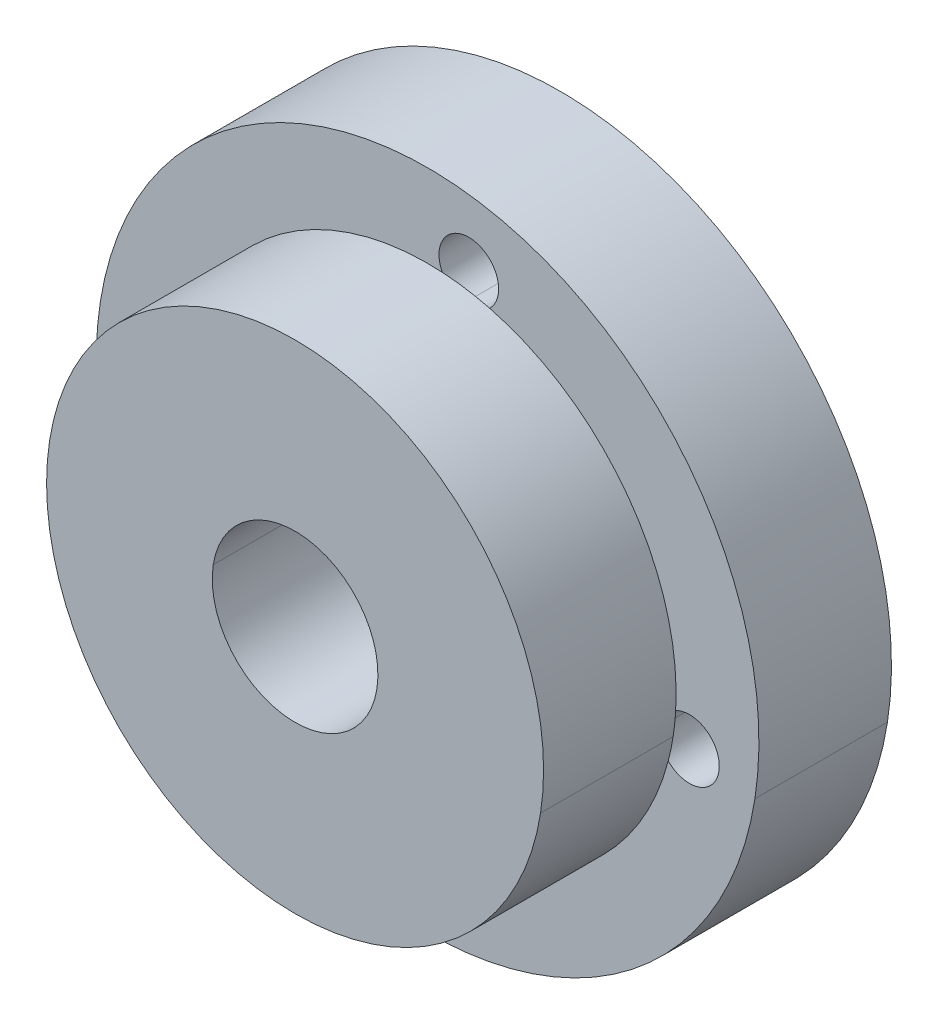
ISO-10303-21;
HEADER;
FILE_DESCRIPTION(('STEP AP214'),'2;1');
FILE_NAME('part.step','',(''),(''),'','','');
FILE_SCHEMA(('AUTOMOTIVE_DESIGN { 1 0 10303 214 1 1 1 1 }'));
ENDSEC;
DATA;
#1=APPLICATION_CONTEXT('core data for automotive mechanical design processes');
#2=APPLICATION_PROTOCOL_DEFINITION('international standard','automotive_design',2000,#1);
#3=PRODUCT_CONTEXT('',#1,'mechanical');
#4=PRODUCT('Part','Part','',(#3));
#5=PRODUCT_RELATED_PRODUCT_CATEGORY('part','',(#4));
#6=PRODUCT_DEFINITION_FORMATION('','',#4);
#7=PRODUCT_DEFINITION_CONTEXT('part definition',#1,'design');
#8=PRODUCT_DEFINITION('design','',#6,#7);
#9=PRODUCT_DEFINITION_SHAPE('','',#8);
#10=(LENGTH_UNIT() NAMED_UNIT(*) SI_UNIT(.MILLI.,.METRE.));
#11=(NAMED_UNIT(*) PLANE_ANGLE_UNIT() SI_UNIT($,.RADIAN.));
#12=(NAMED_UNIT(*) SI_UNIT($,.STERADIAN.) SOLID_ANGLE_UNIT());
#13=UNCERTAINTY_MEASURE_WITH_UNIT(LENGTH_MEASURE(1.E-05),#10,'distance_accuracy_value','');
#14=(GEOMETRIC_REPRESENTATION_CONTEXT(3) GLOBAL_UNCERTAINTY_ASSIGNED_CONTEXT((#13)) GLOBAL_UNIT_ASSIGNED_CONTEXT((#10,
#11,#12)) REPRESENTATION_CONTEXT('',''));
#15=CARTESIAN_POINT('',(0.,0.,0.));
#16=DIRECTION('',(0.,0.,1.));
#17=DIRECTION('',(1.,0.,0.));
#18=AXIS2_PLACEMENT_3D('',#15,#16,#17);
#19=CARTESIAN_POINT('',(172.540515397,-49.500004703,198.848278345));
#20=DIRECTION('',(0.,0.,1.));
#21=DIRECTION('',(1.,0.,0.));
#22=AXIS2_PLACEMENT_3D('',#19,#20,#21);
#23=PLANE('',#22);
#24=CARTESIAN_POINT('',(164.637737646,-48.256580477,198.848278346));
#25=DIRECTION('',(0.,0.,-1.));
#26=DIRECTION('',(0.98784721901284,-0.155428028002022,0.));
#27=AXIS2_PLACEMENT_3D('',#24,#25,#26);
#28=CIRCLE('',#27,0.900000000000014);
#29=CARTESIAN_POINT('',(165.278722749,-47.624806706,198.848278346));
#30=VERTEX_POINT('',#29);
#31=CARTESIAN_POINT('',(165.526800143112,-48.3964657022018,198.848278346));
#32=VERTEX_POINT('',#31);
#33=EDGE_CURVE('E351',#30,#32,#28,.T.);
#34=ORIENTED_EDGE('',*,*,#33,.T.);
#35=CARTESIAN_POINT('',(164.637737646,-48.256580477,198.848278346));
#36=DIRECTION('',(0.,0.,-1.));
#37=DIRECTION('',(0.98784721901284,-0.155428028002022,0.));
#38=AXIS2_PLACEMENT_3D('',#35,#36,#37);
#39=CIRCLE('',#38,0.900000000000014);
#40=CARTESIAN_POINT('',(165.053749067,-49.054662238,198.848278346));
#41=VERTEX_POINT('',#40);
#42=EDGE_CURVE('E190',#32,#41,#39,.T.);
#43=ORIENTED_EDGE('',*,*,#42,.T.);
#44=CARTESIAN_POINT('',(172.540515397,-49.500004703,198.848278345));
#45=DIRECTION('',(0.,0.,-1.));
#46=DIRECTION('',(-0.987847219012841,0.15542802800202,0.));
#47=AXIS2_PLACEMENT_3D('',#44,#45,#46);
#48=CIRCLE('',#47,7.5);
#49=CARTESIAN_POINT('',(165.131661254404,-48.3342944929849,198.848278345));
#50=VERTEX_POINT('',#49);
#51=EDGE_CURVE('E185',#41,#50,#48,.T.);
#52=ORIENTED_EDGE('',*,*,#51,.T.);
#53=CARTESIAN_POINT('',(172.540515397,-49.500004703,198.848278345));
#54=DIRECTION('',(0.,0.,-1.));
#55=DIRECTION('',(-0.987847219012841,0.15542802800202,0.));
#56=AXIS2_PLACEMENT_3D('',#53,#54,#55);
#57=CIRCLE('',#56,7.5);
#58=EDGE_CURVE('E188',#50,#30,#57,.T.);
#59=ORIENTED_EDGE('',*,*,#58,.T.);
#60=EDGE_LOOP('',(#34,#43,#52,#59));
#61=FACE_BOUND('',#60,.T.);
#62=ADVANCED_FACE('F16',(#61),#23,.F.);
#63=CARTESIAN_POINT('',(172.540515397,-49.500004703,198.848278345));
#64=DIRECTION('',(0.,0.,1.));
#65=DIRECTION('',(1.,0.,0.));
#66=AXIS2_PLACEMENT_3D('',#63,#64,#65);
#67=PLANE('',#66);
#68=CARTESIAN_POINT('',(171.297091171,-57.402782455,198.848278345));
#69=DIRECTION('',(0.,0.,-1.));
#70=DIRECTION('',(0.98784721901284,-0.155428028002022,0.));
#71=AXIS2_PLACEMENT_3D('',#68,#69,#70);
#72=CIRCLE('',#71,0.900000000000014);
#73=CARTESIAN_POINT('',(170.6653174,-56.761797352,198.848278345));
#74=VERTEX_POINT('',#73);
#75=CARTESIAN_POINT('',(171.436976396202,-56.5137199578884,198.848278345));
#76=VERTEX_POINT('',#75);
#77=EDGE_CURVE('E350',#74,#76,#72,.T.);
#78=ORIENTED_EDGE('',*,*,#77,.T.);
#79=CARTESIAN_POINT('',(171.297091171,-57.402782455,198.848278345));
#80=DIRECTION('',(0.,0.,-1.));
#81=DIRECTION('',(0.98784721901284,-0.155428028002022,0.));
#82=AXIS2_PLACEMENT_3D('',#79,#80,#81);
#83=CIRCLE('',#82,0.900000000000014);
#84=CARTESIAN_POINT('',(172.095172932,-56.986771034,198.848278345));
#85=VERTEX_POINT('',#84);
#86=EDGE_CURVE('E265',#76,#85,#83,.T.);
#87=ORIENTED_EDGE('',*,*,#86,.T.);
#88=CARTESIAN_POINT('',(172.540515397,-49.500004703,198.848278345));
#89=DIRECTION('',(0.,0.,-1.));
#90=DIRECTION('',(-0.987847219012841,0.15542802800202,0.));
#91=AXIS2_PLACEMENT_3D('',#88,#89,#90);
#92=CIRCLE('',#91,7.5);
#93=EDGE_CURVE('E25',#85,#74,#92,.T.);
#94=ORIENTED_EDGE('',*,*,#93,.T.);
#95=EDGE_LOOP('',(#78,#87,#94));
#96=FACE_BOUND('',#95,.T.);
#97=ADVANCED_FACE('F472',(#96),#67,.F.);
#98=CARTESIAN_POINT('',(172.540515397,-49.500004703,198.848278345));
#99=DIRECTION('',(0.,0.,1.));
#100=DIRECTION('',(1.,0.,0.));
#101=AXIS2_PLACEMENT_3D('',#98,#99,#100);
#102=PLANE('',#101);
#103=CARTESIAN_POINT('',(180.443293149,-50.74342893,198.848278345));
#104=DIRECTION('',(0.,0.,-1.));
#105=DIRECTION('',(0.98784721901284,-0.155428028002022,0.));
#106=AXIS2_PLACEMENT_3D('',#103,#104,#105);
#107=CIRCLE('',#106,0.900000000000014);
#108=CARTESIAN_POINT('',(179.802308046,-51.3752027,198.848278345));
#109=VERTEX_POINT('',#108);
#110=CARTESIAN_POINT('',(179.554230651889,-50.6035437047982,198.848278345));
#111=VERTEX_POINT('',#110);
#112=EDGE_CURVE('E295',#109,#111,#107,.T.);
#113=ORIENTED_EDGE('',*,*,#112,.T.);
#114=CARTESIAN_POINT('',(180.443293149,-50.74342893,198.848278345));
#115=DIRECTION('',(0.,0.,-1.));
#116=DIRECTION('',(0.98784721901284,-0.155428028002022,0.));
#117=AXIS2_PLACEMENT_3D('',#114,#115,#116);
#118=CIRCLE('',#117,0.900000000000014);
#119=CARTESIAN_POINT('',(180.027281728,-49.945347168,198.848278345));
#120=VERTEX_POINT('',#119);
#121=EDGE_CURVE('E326',#111,#120,#118,.T.);
#122=ORIENTED_EDGE('',*,*,#121,.T.);
#123=CARTESIAN_POINT('',(172.540515397,-49.500004703,198.848278345));
#124=DIRECTION('',(0.,0.,-1.));
#125=DIRECTION('',(-0.987847219012841,0.15542802800202,0.));
#126=AXIS2_PLACEMENT_3D('',#123,#124,#125);
#127=CIRCLE('',#126,7.5);
#128=CARTESIAN_POINT('',(179.949369539597,-50.6657149130152,198.848278345));
#129=VERTEX_POINT('',#128);
#130=EDGE_CURVE('E221',#120,#129,#127,.T.);
#131=ORIENTED_EDGE('',*,*,#130,.T.);
#132=CARTESIAN_POINT('',(172.540515397,-49.500004703,198.848278345));
#133=DIRECTION('',(0.,0.,-1.));
#134=DIRECTION('',(-0.987847219012841,0.15542802800202,0.));
#135=AXIS2_PLACEMENT_3D('',#132,#133,#134);
#136=CIRCLE('',#135,7.5);
#137=EDGE_CURVE('E11',#129,#109,#136,.T.);
#138=ORIENTED_EDGE('',*,*,#137,.T.);
#139=EDGE_LOOP('',(#113,#122,#131,#138));
#140=FACE_BOUND('',#139,.T.);
#141=ADVANCED_FACE('F412',(#140),#102,.F.);
#142=CARTESIAN_POINT('',(172.540515397,-49.500004703,198.848278345));
#143=DIRECTION('',(0.,0.,1.));
#144=DIRECTION('',(1.,0.,0.));
#145=AXIS2_PLACEMENT_3D('',#142,#143,#144);
#146=PLANE('',#145);
#147=CARTESIAN_POINT('',(173.783939624,-41.597226951,198.848278345));
#148=DIRECTION('',(0.,0.,-1.));
#149=DIRECTION('',(0.98784721901284,-0.155428028002022,0.));
#150=AXIS2_PLACEMENT_3D('',#147,#148,#149);
#151=CIRCLE('',#150,0.900000000000014);
#152=CARTESIAN_POINT('',(174.415713395,-42.238212055,198.848278345));
#153=VERTEX_POINT('',#152);
#154=CARTESIAN_POINT('',(173.644054398798,-42.4862894481115,198.848278345));
#155=VERTEX_POINT('',#154);
#156=EDGE_CURVE('E387',#153,#155,#151,.T.);
#157=ORIENTED_EDGE('',*,*,#156,.T.);
#158=CARTESIAN_POINT('',(173.783939624,-41.597226951,198.848278345));
#159=DIRECTION('',(0.,0.,-1.));
#160=DIRECTION('',(0.98784721901284,-0.155428028002022,0.));
#161=AXIS2_PLACEMENT_3D('',#158,#159,#160);
#162=CIRCLE('',#161,0.900000000000014);
#163=CARTESIAN_POINT('',(172.985857863,-42.013238372,198.848278345));
#164=VERTEX_POINT('',#163);
#165=EDGE_CURVE('E293',#155,#164,#162,.T.);
#166=ORIENTED_EDGE('',*,*,#165,.T.);
#167=CARTESIAN_POINT('',(172.540515397,-49.500004703,198.848278345));
#168=DIRECTION('',(0.,0.,-1.));
#169=DIRECTION('',(-0.987847219012841,0.15542802800202,0.));
#170=AXIS2_PLACEMENT_3D('',#167,#168,#169);
#171=CIRCLE('',#170,7.5);
#172=EDGE_CURVE('E220',#164,#153,#171,.T.);
#173=ORIENTED_EDGE('',*,*,#172,.T.);
#174=EDGE_LOOP('',(#157,#166,#173));
#175=FACE_BOUND('',#174,.T.);
#176=ADVANCED_FACE('F427',(#175),#146,.F.);
#177=CARTESIAN_POINT('',(172.540515397,-49.500004703,198.848278345));
#178=DIRECTION('',(0.,0.,1.));
#179=DIRECTION('',(0.987847219012841,-0.15542802800202,0.));
#180=AXIS2_PLACEMENT_3D('',#177,#178,#179);
#181=CYLINDRICAL_SURFACE('',#180,7.5);
#182=DIRECTION('',(0.,0.,1.));
#183=VECTOR('',#182,1.);
#184=CARTESIAN_POINT('',(165.131661254404,-48.3342944929849,198.848278345));
#185=LINE('',#184,#183);
#186=CARTESIAN_POINT('',(165.131661254404,-48.3342944929849,202.848278345));
#187=VERTEX_POINT('',#186);
#188=EDGE_CURVE('E196',#50,#187,#185,.T.);
#189=ORIENTED_EDGE('',*,*,#188,.F.);
#190=ORIENTED_EDGE('',*,*,#51,.F.);
#191=CARTESIAN_POINT('',(172.540515397,-49.500004703,198.848278345));
#192=DIRECTION('',(0.,0.,-1.));
#193=DIRECTION('',(-0.987847219012841,0.15542802800202,0.));
#194=AXIS2_PLACEMENT_3D('',#191,#192,#193);
#195=CIRCLE('',#194,7.5);
#196=EDGE_CURVE('E378',#74,#41,#195,.T.);
#197=ORIENTED_EDGE('',*,*,#196,.F.);
#198=ORIENTED_EDGE('',*,*,#93,.F.);
#199=CARTESIAN_POINT('',(172.540515397,-49.500004703,198.848278345));
#200=DIRECTION('',(0.,0.,-1.));
#201=DIRECTION('',(-0.987847219012841,0.15542802800202,0.));
#202=AXIS2_PLACEMENT_3D('',#199,#200,#201);
#203=CIRCLE('',#202,7.5);
#204=EDGE_CURVE('E374',#109,#85,#203,.T.);
#205=ORIENTED_EDGE('',*,*,#204,.F.);
#206=ORIENTED_EDGE('',*,*,#137,.F.);
#207=DIRECTION('',(0.,0.,1.));
#208=VECTOR('',#207,1.);
#209=CARTESIAN_POINT('',(179.949369539597,-50.6657149130152,198.848278345));
#210=LINE('',#209,#208);
#211=CARTESIAN_POINT('',(179.949369539597,-50.6657149130152,202.848278345));
#212=VERTEX_POINT('',#211);
#213=EDGE_CURVE('E228',#129,#212,#210,.T.);
#214=ORIENTED_EDGE('',*,*,#213,.T.);
#215=CARTESIAN_POINT('',(172.540515397,-49.500004703,202.848278345));
#216=DIRECTION('',(0.,0.,1.));
#217=DIRECTION('',(-0.987847219012841,0.15542802800202,0.));
#218=AXIS2_PLACEMENT_3D('',#215,#216,#217);
#219=CIRCLE('',#218,7.5);
#220=EDGE_CURVE('E19',#187,#212,#219,.T.);
#221=ORIENTED_EDGE('',*,*,#220,.F.);
#222=EDGE_LOOP('',(#189,#190,#197,#198,#205,#206,#214,#221));
#223=FACE_BOUND('',#222,.T.);
#224=ADVANCED_FACE('F197',(#223),#181,.T.);
#225=CARTESIAN_POINT('',(172.540515397,-49.500004703,202.848278345));
#226=DIRECTION('',(0.,0.,1.));
#227=DIRECTION('',(1.,0.,0.));
#228=AXIS2_PLACEMENT_3D('',#225,#226,#227);
#229=PLANE('',#228);
#230=CARTESIAN_POINT('',(172.540515397,-49.500004703,202.848278345));
#231=DIRECTION('',(0.,0.,-1.));
#232=DIRECTION('',(-0.987847219012841,0.155428028002019,0.));
#233=AXIS2_PLACEMENT_3D('',#230,#231,#232);
#234=CIRCLE('',#233,2.5);
#235=CARTESIAN_POINT('',(175.010133444532,-49.8885747730051,202.848278345));
#236=VERTEX_POINT('',#235);
#237=CARTESIAN_POINT('',(170.070897349468,-49.111434632995,202.848278345));
#238=VERTEX_POINT('',#237);
#239=EDGE_CURVE('E231',#236,#238,#234,.T.);
#240=ORIENTED_EDGE('',*,*,#239,.T.);
#241=CARTESIAN_POINT('',(172.540515397,-49.500004703,202.848278345));
#242=DIRECTION('',(0.,0.,-1.));
#243=DIRECTION('',(-0.987847219012841,0.155428028002019,0.));
#244=AXIS2_PLACEMENT_3D('',#241,#242,#243);
#245=CIRCLE('',#244,2.5);
#246=EDGE_CURVE('E299',#238,#236,#245,.T.);
#247=ORIENTED_EDGE('',*,*,#246,.T.);
#248=EDGE_LOOP('',(#240,#247));
#249=FACE_BOUND('',#248,.T.);
#250=CARTESIAN_POINT('',(172.540515397,-49.500004703,202.848278345));
#251=DIRECTION('',(0.,0.,1.));
#252=DIRECTION('',(-0.987847219012841,0.15542802800202,0.));
#253=AXIS2_PLACEMENT_3D('',#250,#251,#252);
#254=CIRCLE('',#253,7.5);
#255=EDGE_CURVE('E203',#212,#187,#254,.T.);
#256=ORIENTED_EDGE('',*,*,#255,.T.);
#257=ORIENTED_EDGE('',*,*,#220,.T.);
#258=EDGE_LOOP('',(#256,#257));
#259=FACE_BOUND('',#258,.T.);
#260=ADVANCED_FACE('F408',(#249,#259),#229,.T.);
#261=CARTESIAN_POINT('',(172.540515397,-49.500004703,198.848278345));
#262=DIRECTION('',(0.,0.,1.));
#263=DIRECTION('',(1.,0.,0.));
#264=AXIS2_PLACEMENT_3D('',#261,#262,#263);
#265=PLANE('',#264);
#266=CARTESIAN_POINT('',(172.540515397,-49.500004703,198.848278345));
#267=DIRECTION('',(0.,0.,-1.));
#268=DIRECTION('',(-0.987847219012841,0.15542802800202,0.));
#269=AXIS2_PLACEMENT_3D('',#266,#267,#268);
#270=CIRCLE('',#269,7.5);
#271=EDGE_CURVE('E216',#153,#120,#270,.T.);
#272=ORIENTED_EDGE('',*,*,#271,.T.);
#273=CARTESIAN_POINT('',(180.443293149,-50.74342893,198.848278345));
#274=DIRECTION('',(0.,0.,-1.));
#275=DIRECTION('',(0.98784721901284,-0.155428028002022,0.));
#276=AXIS2_PLACEMENT_3D('',#273,#274,#275);
#277=CIRCLE('',#276,0.900000000000014);
#278=CARTESIAN_POINT('',(181.332355646111,-50.8833141552018,198.848278345));
#279=VERTEX_POINT('',#278);
#280=EDGE_CURVE('E316',#120,#279,#277,.T.);
#281=ORIENTED_EDGE('',*,*,#280,.T.);
#282=CARTESIAN_POINT('',(180.443293149,-50.74342893,198.848278345));
#283=DIRECTION('',(0.,0.,-1.));
#284=DIRECTION('',(0.98784721901284,-0.155428028002022,0.));
#285=AXIS2_PLACEMENT_3D('',#282,#283,#284);
#286=CIRCLE('',#285,0.900000000000014);
#287=EDGE_CURVE('E298',#279,#109,#286,.T.);
#288=ORIENTED_EDGE('',*,*,#287,.T.);
#289=ORIENTED_EDGE('',*,*,#204,.T.);
#290=CARTESIAN_POINT('',(171.297091171,-57.402782455,198.848278345));
#291=DIRECTION('',(0.,0.,-1.));
#292=DIRECTION('',(0.98784721901284,-0.155428028002022,0.));
#293=AXIS2_PLACEMENT_3D('',#290,#291,#292);
#294=CIRCLE('',#293,0.900000000000014);
#295=CARTESIAN_POINT('',(171.157205945798,-58.2918449521116,198.848278345));
#296=VERTEX_POINT('',#295);
#297=EDGE_CURVE('E262',#85,#296,#294,.T.);
#298=ORIENTED_EDGE('',*,*,#297,.T.);
#299=CARTESIAN_POINT('',(171.297091171,-57.402782455,198.848278345));
#300=DIRECTION('',(0.,0.,-1.));
#301=DIRECTION('',(0.98784721901284,-0.155428028002022,0.));
#302=AXIS2_PLACEMENT_3D('',#299,#300,#301);
#303=CIRCLE('',#302,0.900000000000014);
#304=EDGE_CURVE('E379',#296,#74,#303,.T.);
#305=ORIENTED_EDGE('',*,*,#304,.T.);
#306=ORIENTED_EDGE('',*,*,#196,.T.);
#307=CARTESIAN_POINT('',(164.637737646,-48.256580477,198.848278346));
#308=DIRECTION('',(0.,0.,-1.));
#309=DIRECTION('',(0.98784721901284,-0.155428028002022,0.));
#310=AXIS2_PLACEMENT_3D('',#307,#308,#309);
#311=CIRCLE('',#310,0.900000000000014);
#312=CARTESIAN_POINT('',(163.748675148889,-48.1166952517982,198.848278346));
#313=VERTEX_POINT('',#312);
#314=EDGE_CURVE('E290',#41,#313,#311,.T.);
#315=ORIENTED_EDGE('',*,*,#314,.T.);
#316=CARTESIAN_POINT('',(164.637737646,-48.256580477,198.848278346));
#317=DIRECTION('',(0.,0.,-1.));
#318=DIRECTION('',(0.98784721901284,-0.155428028002022,0.));
#319=AXIS2_PLACEMENT_3D('',#316,#317,#318);
#320=CIRCLE('',#319,0.900000000000014);
#321=EDGE_CURVE('E347',#313,#30,#320,.T.);
#322=ORIENTED_EDGE('',*,*,#321,.T.);
#323=CARTESIAN_POINT('',(172.540515397,-49.500004703,198.848278345));
#324=DIRECTION('',(0.,0.,-1.));
#325=DIRECTION('',(-0.987847219012841,0.15542802800202,0.));
#326=AXIS2_PLACEMENT_3D('',#323,#324,#325);
#327=CIRCLE('',#326,7.5);
#328=EDGE_CURVE('E209',#30,#164,#327,.T.);
#329=ORIENTED_EDGE('',*,*,#328,.T.);
#330=CARTESIAN_POINT('',(173.783939624,-41.597226951,198.848278345));
#331=DIRECTION('',(0.,0.,-1.));
#332=DIRECTION('',(0.98784721901284,-0.155428028002022,0.));
#333=AXIS2_PLACEMENT_3D('',#330,#331,#332);
#334=CIRCLE('',#333,0.900000000000014);
#335=CARTESIAN_POINT('',(173.923824849202,-40.7081644538885,198.848278345));
#336=VERTEX_POINT('',#335);
#337=EDGE_CURVE('E320',#164,#336,#334,.T.);
#338=ORIENTED_EDGE('',*,*,#337,.T.);
#339=CARTESIAN_POINT('',(173.783939624,-41.597226951,198.848278345));
#340=DIRECTION('',(0.,0.,-1.));
#341=DIRECTION('',(0.98784721901284,-0.155428028002022,0.));
#342=AXIS2_PLACEMENT_3D('',#339,#340,#341);
#343=CIRCLE('',#342,0.900000000000014);
#344=EDGE_CURVE('E390',#336,#153,#343,.T.);
#345=ORIENTED_EDGE('',*,*,#344,.T.);
#346=EDGE_LOOP('',(#272,#281,#288,#289,#298,#305,#306,#315,#322,#329,#338,#345));
#347=FACE_BOUND('',#346,.T.);
#348=CARTESIAN_POINT('',(172.540515397,-49.500004703,198.848278345));
#349=DIRECTION('',(0.,0.,1.));
#350=DIRECTION('',(-0.987847219012841,0.15542802800202,0.));
#351=AXIS2_PLACEMENT_3D('',#348,#349,#350);
#352=CIRCLE('',#351,10.);
#353=CARTESIAN_POINT('',(182.418987587128,-51.0542849830202,198.848278345));
#354=VERTEX_POINT('',#353);
#355=CARTESIAN_POINT('',(162.662043206871,-47.9457244229798,198.848278345));
#356=VERTEX_POINT('',#355);
#357=EDGE_CURVE('E248',#354,#356,#352,.T.);
#358=ORIENTED_EDGE('',*,*,#357,.T.);
#359=CARTESIAN_POINT('',(172.540515397,-49.500004703,198.848278345));
#360=DIRECTION('',(0.,0.,1.));
#361=DIRECTION('',(-0.987847219012841,0.15542802800202,0.));
#362=AXIS2_PLACEMENT_3D('',#359,#360,#361);
#363=CIRCLE('',#362,10.);
#364=EDGE_CURVE('E373',#356,#354,#363,.T.);
#365=ORIENTED_EDGE('',*,*,#364,.T.);
#366=EDGE_LOOP('',(#358,#365));
#367=FACE_BOUND('',#366,.T.);
#368=ADVANCED_FACE('F417',(#347,#367),#265,.T.);
#369=CARTESIAN_POINT('',(171.297091171,-57.402782455,198.848278345));
#370=DIRECTION('',(0.,0.,-1.));
#371=DIRECTION('',(-0.155428028002009,-0.987847219012842,0.));
#372=AXIS2_PLACEMENT_3D('',#369,#370,#371);
#373=CYLINDRICAL_SURFACE('',#372,0.9);
#374=DIRECTION('',(0.,0.,-1.));
#375=VECTOR('',#374,1.);
#376=CARTESIAN_POINT('',(171.436976396202,-56.5137199578884,198.848278345));
#377=LINE('',#376,#375);
#378=CARTESIAN_POINT('',(171.436976396202,-56.5137199578884,194.848278345));
#379=VERTEX_POINT('',#378);
#380=EDGE_CURVE('E272',#76,#379,#377,.T.);
#381=ORIENTED_EDGE('',*,*,#380,.F.);
#382=ORIENTED_EDGE('',*,*,#77,.F.);
#383=ORIENTED_EDGE('',*,*,#304,.F.);
#384=DIRECTION('',(0.,0.,-1.));
#385=VECTOR('',#384,1.);
#386=CARTESIAN_POINT('',(171.157205945798,-58.2918449521116,198.848278345));
#387=LINE('',#386,#385);
#388=CARTESIAN_POINT('',(171.157205945798,-58.2918449521116,194.848278345));
#389=VERTEX_POINT('',#388);
#390=EDGE_CURVE('E273',#296,#389,#387,.T.);
#391=ORIENTED_EDGE('',*,*,#390,.T.);
#392=CARTESIAN_POINT('',(171.297091171,-57.402782455,194.848278345));
#393=DIRECTION('',(0.,0.,1.));
#394=DIRECTION('',(0.98784721901284,-0.155428028002022,0.));
#395=AXIS2_PLACEMENT_3D('',#392,#393,#394);
#396=CIRCLE('',#395,0.900000000000014);
#397=EDGE_CURVE('E370',#379,#389,#396,.T.);
#398=ORIENTED_EDGE('',*,*,#397,.F.);
#399=EDGE_LOOP('',(#381,#382,#383,#391,#398));
#400=FACE_BOUND('',#399,.T.);
#401=ADVANCED_FACE('F458',(#400),#373,.F.);
#402=CARTESIAN_POINT('',(164.637737646,-48.256580477,198.848278346));
#403=DIRECTION('',(0.,0.,-1.));
#404=DIRECTION('',(-0.98784721901284,0.155428028002022,0.));
#405=AXIS2_PLACEMENT_3D('',#402,#403,#404);
#406=CYLINDRICAL_SURFACE('',#405,0.900000000000014);
#407=DIRECTION('',(0.,0.,-1.));
#408=VECTOR('',#407,1.);
#409=CARTESIAN_POINT('',(165.526800143112,-48.3964657022018,198.848278346));
#410=LINE('',#409,#408);
#411=CARTESIAN_POINT('',(165.526800143112,-48.3964657022018,194.848278346));
#412=VERTEX_POINT('',#411);
#413=EDGE_CURVE('E250',#32,#412,#410,.T.);
#414=ORIENTED_EDGE('',*,*,#413,.F.);
#415=ORIENTED_EDGE('',*,*,#33,.F.);
#416=ORIENTED_EDGE('',*,*,#321,.F.);
#417=DIRECTION('',(0.,0.,-1.));
#418=VECTOR('',#417,1.);
#419=CARTESIAN_POINT('',(163.748675148889,-48.1166952517982,198.848278346));
#420=LINE('',#419,#418);
#421=CARTESIAN_POINT('',(163.748675148889,-48.1166952517982,194.848278346));
#422=VERTEX_POINT('',#421);
#423=EDGE_CURVE('E269',#313,#422,#420,.T.);
#424=ORIENTED_EDGE('',*,*,#423,.T.);
#425=CARTESIAN_POINT('',(164.637737646,-48.256580477,194.848278346));
#426=DIRECTION('',(0.,0.,1.));
#427=DIRECTION('',(0.98784721901284,-0.155428028002022,0.));
#428=AXIS2_PLACEMENT_3D('',#425,#426,#427);
#429=CIRCLE('',#428,0.900000000000014);
#430=EDGE_CURVE('E330',#412,#422,#429,.T.);
#431=ORIENTED_EDGE('',*,*,#430,.F.);
#432=EDGE_LOOP('',(#414,#415,#416,#424,#431));
#433=FACE_BOUND('',#432,.T.);
#434=ADVANCED_FACE('F433',(#433),#406,.F.);
#435=CARTESIAN_POINT('',(173.783939624,-41.597226951,198.848278345));
#436=DIRECTION('',(0.,0.,-1.));
#437=DIRECTION('',(0.155428028002009,0.987847219012842,0.));
#438=AXIS2_PLACEMENT_3D('',#435,#436,#437);
#439=CYLINDRICAL_SURFACE('',#438,0.9);
#440=DIRECTION('',(0.,0.,-1.));
#441=VECTOR('',#440,1.);
#442=CARTESIAN_POINT('',(173.644054398798,-42.4862894481115,198.848278345));
#443=LINE('',#442,#441);
#444=CARTESIAN_POINT('',(173.644054398798,-42.4862894481115,194.848278345));
#445=VERTEX_POINT('',#444);
#446=EDGE_CURVE('E303',#155,#445,#443,.T.);
#447=ORIENTED_EDGE('',*,*,#446,.F.);
#448=ORIENTED_EDGE('',*,*,#156,.F.);
#449=ORIENTED_EDGE('',*,*,#344,.F.);
#450=DIRECTION('',(0.,0.,-1.));
#451=VECTOR('',#450,1.);
#452=CARTESIAN_POINT('',(173.923824849202,-40.7081644538885,198.848278345));
#453=LINE('',#452,#451);
#454=CARTESIAN_POINT('',(173.923824849202,-40.7081644538885,194.848278345));
#455=VERTEX_POINT('',#454);
#456=EDGE_CURVE('E311',#336,#455,#453,.T.);
#457=ORIENTED_EDGE('',*,*,#456,.T.);
#458=CARTESIAN_POINT('',(173.783939624,-41.597226951,194.848278345));
#459=DIRECTION('',(0.,0.,1.));
#460=DIRECTION('',(0.98784721901284,-0.155428028002022,0.));
#461=AXIS2_PLACEMENT_3D('',#458,#459,#460);
#462=CIRCLE('',#461,0.900000000000014);
#463=EDGE_CURVE('E327',#445,#455,#462,.T.);
#464=ORIENTED_EDGE('',*,*,#463,.F.);
#465=EDGE_LOOP('',(#447,#448,#449,#457,#464));
#466=FACE_BOUND('',#465,.T.);
#467=ADVANCED_FACE('F424',(#466),#439,.F.);
#468=CARTESIAN_POINT('',(180.443293149,-50.74342893,198.848278345));
#469=DIRECTION('',(0.,0.,-1.));
#470=DIRECTION('',(0.98784721901284,-0.155428028002022,0.));
#471=AXIS2_PLACEMENT_3D('',#468,#469,#470);
#472=CYLINDRICAL_SURFACE('',#471,0.900000000000014);
#473=DIRECTION('',(0.,0.,-1.));
#474=VECTOR('',#473,1.);
#475=CARTESIAN_POINT('',(179.554230651889,-50.6035437047982,198.848278345));
#476=LINE('',#475,#474);
#477=CARTESIAN_POINT('',(179.554230651889,-50.6035437047982,194.848278345));
#478=VERTEX_POINT('',#477);
#479=EDGE_CURVE('E227',#111,#478,#476,.T.);
#480=ORIENTED_EDGE('',*,*,#479,.F.);
#481=ORIENTED_EDGE('',*,*,#112,.F.);
#482=ORIENTED_EDGE('',*,*,#287,.F.);
#483=DIRECTION('',(0.,0.,-1.));
#484=VECTOR('',#483,1.);
#485=CARTESIAN_POINT('',(181.332355646111,-50.8833141552018,198.848278345));
#486=LINE('',#485,#484);
#487=CARTESIAN_POINT('',(181.332355646111,-50.8833141552018,194.848278345));
#488=VERTEX_POINT('',#487);
#489=EDGE_CURVE('E226',#279,#488,#486,.T.);
#490=ORIENTED_EDGE('',*,*,#489,.T.);
#491=CARTESIAN_POINT('',(180.443293149,-50.74342893,194.848278345));
#492=DIRECTION('',(0.,0.,1.));
#493=DIRECTION('',(0.98784721901284,-0.155428028002022,0.));
#494=AXIS2_PLACEMENT_3D('',#491,#492,#493);
#495=CIRCLE('',#494,0.900000000000014);
#496=EDGE_CURVE('E331',#478,#488,#495,.T.);
#497=ORIENTED_EDGE('',*,*,#496,.F.);
#498=EDGE_LOOP('',(#480,#481,#482,#490,#497));
#499=FACE_BOUND('',#498,.T.);
#500=ADVANCED_FACE('F530',(#499),#472,.F.);
#501=CARTESIAN_POINT('',(172.540515397,-49.500004703,194.848278345));
#502=DIRECTION('',(0.,0.,1.));
#503=DIRECTION('',(0.987847219012841,-0.155428028002019,0.));
#504=AXIS2_PLACEMENT_3D('',#501,#502,#503);
#505=CYLINDRICAL_SURFACE('',#504,2.5);
#506=DIRECTION('',(0.,0.,1.));
#507=VECTOR('',#506,1.);
#508=CARTESIAN_POINT('',(170.070897349468,-49.111434632995,194.848278345));
#509=LINE('',#508,#507);
#510=CARTESIAN_POINT('',(170.070897349468,-49.111434632995,194.848278345));
#511=VERTEX_POINT('',#510);
#512=EDGE_CURVE('E236',#511,#238,#509,.T.);
#513=ORIENTED_EDGE('',*,*,#512,.F.);
#514=CARTESIAN_POINT('',(172.540515397,-49.500004703,194.848278345));
#515=DIRECTION('',(0.,0.,1.));
#516=DIRECTION('',(-0.987847219012841,0.155428028002019,0.));
#517=AXIS2_PLACEMENT_3D('',#514,#515,#516);
#518=CIRCLE('',#517,2.5);
#519=CARTESIAN_POINT('',(175.010133444532,-49.8885747730051,194.848278345));
#520=VERTEX_POINT('',#519);
#521=EDGE_CURVE('E258',#520,#511,#518,.T.);
#522=ORIENTED_EDGE('',*,*,#521,.F.);
#523=DIRECTION('',(0.,0.,1.));
#524=VECTOR('',#523,1.);
#525=CARTESIAN_POINT('',(175.010133444532,-49.8885747730051,194.848278345));
#526=LINE('',#525,#524);
#527=EDGE_CURVE('E235',#520,#236,#526,.T.);
#528=ORIENTED_EDGE('',*,*,#527,.T.);
#529=ORIENTED_EDGE('',*,*,#246,.F.);
#530=EDGE_LOOP('',(#513,#522,#528,#529));
#531=FACE_BOUND('',#530,.T.);
#532=ADVANCED_FACE('F541',(#531),#505,.F.);
#533=CARTESIAN_POINT('',(172.540515397,-49.500004703,194.848278345));
#534=DIRECTION('',(0.,0.,1.));
#535=DIRECTION('',(0.987847219012841,-0.15542802800202,0.));
#536=AXIS2_PLACEMENT_3D('',#533,#534,#535);
#537=CYLINDRICAL_SURFACE('',#536,10.);
#538=DIRECTION('',(0.,0.,1.));
#539=VECTOR('',#538,1.);
#540=CARTESIAN_POINT('',(162.662043206871,-47.9457244229798,194.848278345));
#541=LINE('',#540,#539);
#542=CARTESIAN_POINT('',(162.662043206871,-47.9457244229798,194.848278345));
#543=VERTEX_POINT('',#542);
#544=EDGE_CURVE('E244',#543,#356,#541,.T.);
#545=ORIENTED_EDGE('',*,*,#544,.F.);
#546=CARTESIAN_POINT('',(172.540515397,-49.500004703,194.848278345));
#547=DIRECTION('',(0.,0.,-1.));
#548=DIRECTION('',(-0.987847219012841,0.15542802800202,0.));
#549=AXIS2_PLACEMENT_3D('',#546,#547,#548);
#550=CIRCLE('',#549,10.);
#551=CARTESIAN_POINT('',(182.418987587128,-51.0542849830202,194.848278345));
#552=VERTEX_POINT('',#551);
#553=EDGE_CURVE('E255',#552,#543,#550,.T.);
#554=ORIENTED_EDGE('',*,*,#553,.F.);
#555=DIRECTION('',(0.,0.,1.));
#556=VECTOR('',#555,1.);
#557=CARTESIAN_POINT('',(182.418987587128,-51.0542849830202,194.848278345));
#558=LINE('',#557,#556);
#559=EDGE_CURVE('E259',#552,#354,#558,.T.);
#560=ORIENTED_EDGE('',*,*,#559,.T.);
#561=ORIENTED_EDGE('',*,*,#364,.F.);
#562=EDGE_LOOP('',(#545,#554,#560,#561));
#563=FACE_BOUND('',#562,.T.);
#564=ADVANCED_FACE('F442',(#563),#537,.T.);
#565=CARTESIAN_POINT('',(172.540515397,-49.500004703,194.848278345));
#566=DIRECTION('',(0.,0.,1.));
#567=DIRECTION('',(1.,0.,0.));
#568=AXIS2_PLACEMENT_3D('',#565,#566,#567);
#569=PLANE('',#568);
#570=CARTESIAN_POINT('',(171.297091171,-57.402782455,194.848278345));
#571=DIRECTION('',(0.,0.,1.));
#572=DIRECTION('',(0.98784721901284,-0.155428028002022,0.));
#573=AXIS2_PLACEMENT_3D('',#570,#571,#572);
#574=CIRCLE('',#573,0.900000000000014);
#575=EDGE_CURVE('E277',#389,#379,#574,.T.);
#576=ORIENTED_EDGE('',*,*,#575,.T.);
#577=ORIENTED_EDGE('',*,*,#397,.T.);
#578=EDGE_LOOP('',(#576,#577));
#579=FACE_BOUND('',#578,.T.);
#580=CARTESIAN_POINT('',(164.637737646,-48.256580477,194.848278346));
#581=DIRECTION('',(0.,0.,1.));
#582=DIRECTION('',(0.98784721901284,-0.155428028002022,0.));
#583=AXIS2_PLACEMENT_3D('',#580,#581,#582);
#584=CIRCLE('',#583,0.900000000000014);
#585=EDGE_CURVE('E254',#422,#412,#584,.T.);
#586=ORIENTED_EDGE('',*,*,#585,.T.);
#587=ORIENTED_EDGE('',*,*,#430,.T.);
#588=EDGE_LOOP('',(#586,#587));
#589=FACE_BOUND('',#588,.T.);
#590=CARTESIAN_POINT('',(173.783939624,-41.597226951,194.848278345));
#591=DIRECTION('',(0.,0.,1.));
#592=DIRECTION('',(0.98784721901284,-0.155428028002022,0.));
#593=AXIS2_PLACEMENT_3D('',#590,#591,#592);
#594=CIRCLE('',#593,0.900000000000014);
#595=EDGE_CURVE('E306',#455,#445,#594,.T.);
#596=ORIENTED_EDGE('',*,*,#595,.T.);
#597=ORIENTED_EDGE('',*,*,#463,.T.);
#598=EDGE_LOOP('',(#596,#597));
#599=FACE_BOUND('',#598,.T.);
#600=CARTESIAN_POINT('',(180.443293149,-50.74342893,194.848278345));
#601=DIRECTION('',(0.,0.,1.));
#602=DIRECTION('',(0.98784721901284,-0.155428028002022,0.));
#603=AXIS2_PLACEMENT_3D('',#600,#601,#602);
#604=CIRCLE('',#603,0.900000000000014);
#605=EDGE_CURVE('E222',#488,#478,#604,.T.);
#606=ORIENTED_EDGE('',*,*,#605,.T.);
#607=ORIENTED_EDGE('',*,*,#496,.T.);
#608=EDGE_LOOP('',(#606,#607));
#609=FACE_BOUND('',#608,.T.);
#610=ORIENTED_EDGE('',*,*,#521,.T.);
#611=CARTESIAN_POINT('',(172.540515397,-49.500004703,194.848278345));
#612=DIRECTION('',(0.,0.,1.));
#613=DIRECTION('',(-0.987847219012841,0.155428028002019,0.));
#614=AXIS2_PLACEMENT_3D('',#611,#612,#613);
#615=CIRCLE('',#614,2.5);
#616=EDGE_CURVE('E312',#511,#520,#615,.T.);
#617=ORIENTED_EDGE('',*,*,#616,.T.);
#618=EDGE_LOOP('',(#610,#617));
#619=FACE_BOUND('',#618,.T.);
#620=ORIENTED_EDGE('',*,*,#553,.T.);
#621=CARTESIAN_POINT('',(172.540515397,-49.500004703,194.848278345));
#622=DIRECTION('',(0.,0.,-1.));
#623=DIRECTION('',(-0.987847219012841,0.15542802800202,0.));
#624=AXIS2_PLACEMENT_3D('',#621,#622,#623);
#625=CIRCLE('',#624,10.);
#626=EDGE_CURVE('E249',#543,#552,#625,.T.);
#627=ORIENTED_EDGE('',*,*,#626,.T.);
#628=EDGE_LOOP('',(#620,#627));
#629=FACE_BOUND('',#628,.T.);
#630=ADVANCED_FACE('F438',(#579,#589,#599,#609,#619,#629),#569,.F.);
#631=CARTESIAN_POINT('',(172.540515397,-49.500004703,194.848278345));
#632=DIRECTION('',(0.,0.,1.));
#633=DIRECTION('',(0.987847219012841,-0.15542802800202,0.));
#634=AXIS2_PLACEMENT_3D('',#631,#632,#633);
#635=CYLINDRICAL_SURFACE('',#634,10.);
#636=ORIENTED_EDGE('',*,*,#626,.F.);
#637=ORIENTED_EDGE('',*,*,#544,.T.);
#638=ORIENTED_EDGE('',*,*,#357,.F.);
#639=ORIENTED_EDGE('',*,*,#559,.F.);
#640=EDGE_LOOP('',(#636,#637,#638,#639));
#641=FACE_BOUND('',#640,.T.);
#642=ADVANCED_FACE('F441',(#641),#635,.T.);
#643=CARTESIAN_POINT('',(172.540515397,-49.500004703,194.848278345));
#644=DIRECTION('',(0.,0.,1.));
#645=DIRECTION('',(0.987847219012841,-0.155428028002019,0.));
#646=AXIS2_PLACEMENT_3D('',#643,#644,#645);
#647=CYLINDRICAL_SURFACE('',#646,2.5);
#648=ORIENTED_EDGE('',*,*,#616,.F.);
#649=ORIENTED_EDGE('',*,*,#512,.T.);
#650=ORIENTED_EDGE('',*,*,#239,.F.);
#651=ORIENTED_EDGE('',*,*,#527,.F.);
#652=EDGE_LOOP('',(#648,#649,#650,#651));
#653=FACE_BOUND('',#652,.T.);
#654=ADVANCED_FACE('F580',(#653),#647,.F.);
#655=CARTESIAN_POINT('',(180.443293149,-50.74342893,198.848278345));
#656=DIRECTION('',(0.,0.,-1.));
#657=DIRECTION('',(0.98784721901284,-0.155428028002022,0.));
#658=AXIS2_PLACEMENT_3D('',#655,#656,#657);
#659=CYLINDRICAL_SURFACE('',#658,0.900000000000014);
#660=ORIENTED_EDGE('',*,*,#121,.F.);
#661=ORIENTED_EDGE('',*,*,#479,.T.);
#662=ORIENTED_EDGE('',*,*,#605,.F.);
#663=ORIENTED_EDGE('',*,*,#489,.F.);
#664=ORIENTED_EDGE('',*,*,#280,.F.);
#665=EDGE_LOOP('',(#660,#661,#662,#663,#664));
#666=FACE_BOUND('',#665,.T.);
#667=ADVANCED_FACE('F590',(#666),#659,.F.);
#668=CARTESIAN_POINT('',(173.783939624,-41.597226951,198.848278345));
#669=DIRECTION('',(0.,0.,-1.));
#670=DIRECTION('',(0.155428028002009,0.987847219012842,0.));
#671=AXIS2_PLACEMENT_3D('',#668,#669,#670);
#672=CYLINDRICAL_SURFACE('',#671,0.9);
#673=ORIENTED_EDGE('',*,*,#165,.F.);
#674=ORIENTED_EDGE('',*,*,#446,.T.);
#675=ORIENTED_EDGE('',*,*,#595,.F.);
#676=ORIENTED_EDGE('',*,*,#456,.F.);
#677=ORIENTED_EDGE('',*,*,#337,.F.);
#678=EDGE_LOOP('',(#673,#674,#675,#676,#677));
#679=FACE_BOUND('',#678,.T.);
#680=ADVANCED_FACE('F600',(#679),#672,.F.);
#681=CARTESIAN_POINT('',(164.637737646,-48.256580477,198.848278346));
#682=DIRECTION('',(0.,0.,-1.));
#683=DIRECTION('',(-0.98784721901284,0.155428028002022,0.));
#684=AXIS2_PLACEMENT_3D('',#681,#682,#683);
#685=CYLINDRICAL_SURFACE('',#684,0.900000000000014);
#686=ORIENTED_EDGE('',*,*,#42,.F.);
#687=ORIENTED_EDGE('',*,*,#413,.T.);
#688=ORIENTED_EDGE('',*,*,#585,.F.);
#689=ORIENTED_EDGE('',*,*,#423,.F.);
#690=ORIENTED_EDGE('',*,*,#314,.F.);
#691=EDGE_LOOP('',(#686,#687,#688,#689,#690));
#692=FACE_BOUND('',#691,.T.);
#693=ADVANCED_FACE('F436',(#692),#685,.F.);
#694=CARTESIAN_POINT('',(171.297091171,-57.402782455,198.848278345));
#695=DIRECTION('',(0.,0.,-1.));
#696=DIRECTION('',(-0.155428028002009,-0.987847219012842,0.));
#697=AXIS2_PLACEMENT_3D('',#694,#695,#696);
#698=CYLINDRICAL_SURFACE('',#697,0.9);
#699=ORIENTED_EDGE('',*,*,#86,.F.);
#700=ORIENTED_EDGE('',*,*,#380,.T.);
#701=ORIENTED_EDGE('',*,*,#575,.F.);
#702=ORIENTED_EDGE('',*,*,#390,.F.);
#703=ORIENTED_EDGE('',*,*,#297,.F.);
#704=EDGE_LOOP('',(#699,#700,#701,#702,#703));
#705=FACE_BOUND('',#704,.T.);
#706=ADVANCED_FACE('F617',(#705),#698,.F.);
#707=CARTESIAN_POINT('',(172.540515397,-49.500004703,198.848278345));
#708=DIRECTION('',(0.,0.,1.));
#709=DIRECTION('',(0.987847219012841,-0.15542802800202,0.));
#710=AXIS2_PLACEMENT_3D('',#707,#708,#709);
#711=CYLINDRICAL_SURFACE('',#710,7.5);
#712=ORIENTED_EDGE('',*,*,#58,.F.);
#713=ORIENTED_EDGE('',*,*,#188,.T.);
#714=ORIENTED_EDGE('',*,*,#255,.F.);
#715=ORIENTED_EDGE('',*,*,#213,.F.);
#716=ORIENTED_EDGE('',*,*,#130,.F.);
#717=ORIENTED_EDGE('',*,*,#271,.F.);
#718=ORIENTED_EDGE('',*,*,#172,.F.);
#719=ORIENTED_EDGE('',*,*,#328,.F.);
#720=EDGE_LOOP('',(#712,#713,#714,#715,#716,#717,#718,#719));
#721=FACE_BOUND('',#720,.T.);
#722=ADVANCED_FACE('F206',(#721),#711,.T.);
#723=CLOSED_SHELL('',(#62,#97,#141,#176,#224,#260,#368,#401,#434,#467,#500,#532,#564,#630,#642,
#654,#667,#680,#693,#706,#722));
#724=MANIFOLD_SOLID_BREP('B1',#723);
#725=ADVANCED_BREP_SHAPE_REPRESENTATION('',(#18,#724),#14);
#726=SHAPE_DEFINITION_REPRESENTATION(#9,#725);
ENDSEC;
END-ISO-10303-21;
